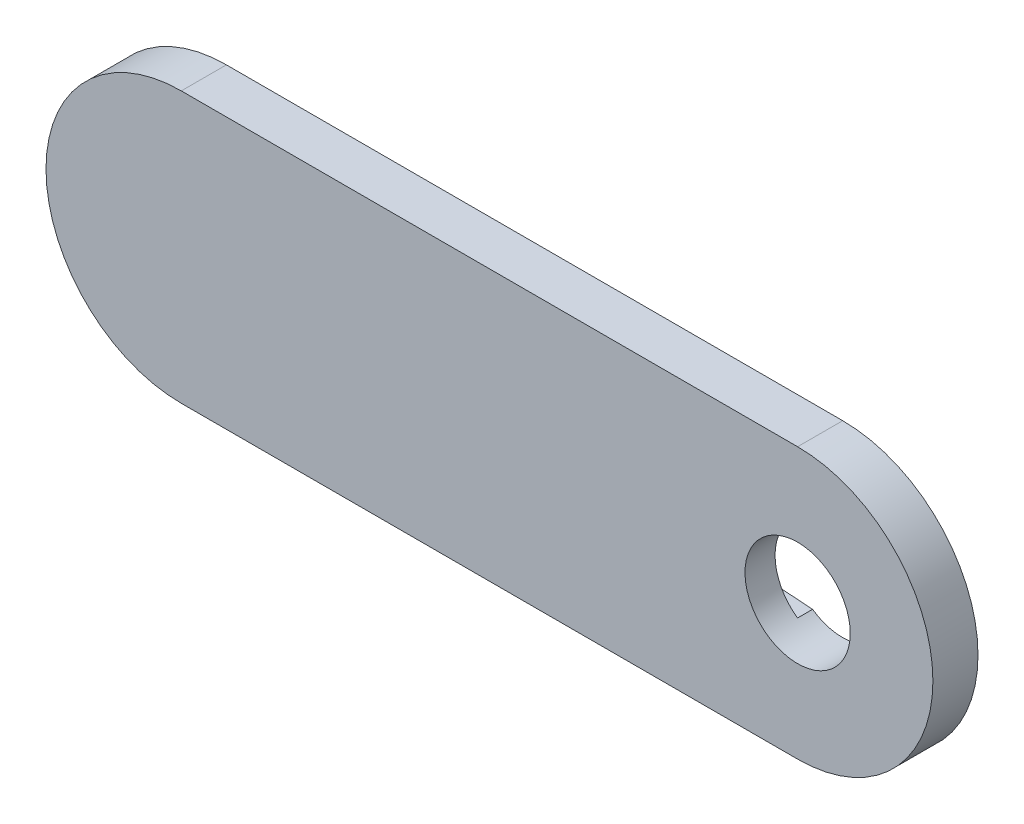
ISO-10303-21;
HEADER;
FILE_DESCRIPTION(('STEP AP214'),'2;1');
FILE_NAME('part.step','',(''),(''),'','','');
FILE_SCHEMA(('AUTOMOTIVE_DESIGN { 1 0 10303 214 1 1 1 1 }'));
ENDSEC;
DATA;
#1=APPLICATION_CONTEXT('core data for automotive mechanical design processes');
#2=APPLICATION_PROTOCOL_DEFINITION('international standard','automotive_design',2000,#1);
#3=PRODUCT_CONTEXT('',#1,'mechanical');
#4=PRODUCT('Part','Part','',(#3));
#5=PRODUCT_RELATED_PRODUCT_CATEGORY('part','',(#4));
#6=PRODUCT_DEFINITION_FORMATION('','',#4);
#7=PRODUCT_DEFINITION_CONTEXT('part definition',#1,'design');
#8=PRODUCT_DEFINITION('design','',#6,#7);
#9=PRODUCT_DEFINITION_SHAPE('','',#8);
#10=(LENGTH_UNIT() NAMED_UNIT(*) SI_UNIT(.MILLI.,.METRE.));
#11=(NAMED_UNIT(*) PLANE_ANGLE_UNIT() SI_UNIT($,.RADIAN.));
#12=(NAMED_UNIT(*) SI_UNIT($,.STERADIAN.) SOLID_ANGLE_UNIT());
#13=UNCERTAINTY_MEASURE_WITH_UNIT(LENGTH_MEASURE(1.E-05),#10,'distance_accuracy_value','');
#14=(GEOMETRIC_REPRESENTATION_CONTEXT(3) GLOBAL_UNCERTAINTY_ASSIGNED_CONTEXT((#13)) GLOBAL_UNIT_ASSIGNED_CONTEXT((#10,
#11,#12)) REPRESENTATION_CONTEXT('',''));
#15=CARTESIAN_POINT('',(0.,0.,0.));
#16=DIRECTION('',(0.,0.,1.));
#17=DIRECTION('',(1.,0.,0.));
#18=AXIS2_PLACEMENT_3D('',#15,#16,#17);
#19=CARTESIAN_POINT('',(72.389373952,13.7053718015999,0.));
#20=DIRECTION('',(0.,0.,1.));
#21=DIRECTION('',(1.,0.,0.));
#22=AXIS2_PLACEMENT_3D('',#19,#20,#21);
#23=PLANE('',#22);
#24=CARTESIAN_POINT('',(72.389373952,13.7053718015999,0.));
#25=DIRECTION('',(0.,0.,1.));
#26=DIRECTION('',(1.,0.,0.));
#27=AXIS2_PLACEMENT_3D('',#24,#25,#26);
#28=CIRCLE('',#27,9.00000000000001);
#29=CARTESIAN_POINT('',(72.389373952,4.7053718016,0.));
#30=VERTEX_POINT('',#29);
#31=CARTESIAN_POINT('',(72.389373952,22.7053718016,0.));
#32=VERTEX_POINT('',#31);
#33=EDGE_CURVE('E139',#30,#32,#28,.T.);
#34=ORIENTED_EDGE('',*,*,#33,.F.);
#35=DIRECTION('',(1.,0.,0.));
#36=VECTOR('',#35,1.);
#37=CARTESIAN_POINT('',(31.389373952,4.7053718016,0.));
#38=LINE('',#37,#36);
#39=CARTESIAN_POINT('',(31.389373952,4.7053718016,0.));
#40=VERTEX_POINT('',#39);
#41=EDGE_CURVE('E78',#40,#30,#38,.T.);
#42=ORIENTED_EDGE('',*,*,#41,.F.);
#43=CARTESIAN_POINT('',(31.389373952,13.7053718016,0.));
#44=DIRECTION('',(0.,0.,1.));
#45=DIRECTION('',(1.,0.,0.));
#46=AXIS2_PLACEMENT_3D('',#43,#44,#45);
#47=CIRCLE('',#46,9.00000000000001);
#48=CARTESIAN_POINT('',(31.389373952,22.7053718016,0.));
#49=VERTEX_POINT('',#48);
#50=EDGE_CURVE('E152',#49,#40,#47,.T.);
#51=ORIENTED_EDGE('',*,*,#50,.F.);
#52=DIRECTION('',(-1.,0.,0.));
#53=VECTOR('',#52,1.);
#54=CARTESIAN_POINT('',(72.389373952,22.7053718016,0.));
#55=LINE('',#54,#53);
#56=EDGE_CURVE('E150',#32,#49,#55,.T.);
#57=ORIENTED_EDGE('',*,*,#56,.F.);
#58=EDGE_LOOP('',(#34,#42,#51,#57));
#59=FACE_BOUND('',#58,.T.);
#60=DIRECTION('',(0.997518113068179,-0.0704103266637762,0.));
#61=VECTOR('',#60,1.);
#62=CARTESIAN_POINT('',(57.9985532986342,11.7103355754357,0.));
#63=LINE('',#62,#61);
#64=CARTESIAN_POINT('',(57.9985532986342,11.7103355754357,0.));
#65=VERTEX_POINT('',#64);
#66=CARTESIAN_POINT('',(70.3851715739607,10.8360197834721,0.));
#67=VERTEX_POINT('',#66);
#68=EDGE_CURVE('E127',#65,#67,#63,.T.);
#69=ORIENTED_EDGE('',*,*,#68,.T.);
#70=CARTESIAN_POINT('',(72.389373952,13.7053718015999,0.));
#71=DIRECTION('',(0.,0.,1.));
#72=DIRECTION('',(1.,0.,0.));
#73=AXIS2_PLACEMENT_3D('',#70,#71,#72);
#74=CIRCLE('',#73,3.50000116801028);
#75=CARTESIAN_POINT('',(70.3851715738942,16.5747238196815,0.));
#76=VERTEX_POINT('',#75);
#77=EDGE_CURVE('E128',#67,#76,#74,.T.);
#78=ORIENTED_EDGE('',*,*,#77,.T.);
#79=DIRECTION('',(-0.9975181130681,-0.070410326664897,0.));
#80=VECTOR('',#79,1.);
#81=CARTESIAN_POINT('',(70.3851715738942,16.5747238196815,0.));
#82=LINE('',#81,#80);
#83=CARTESIAN_POINT('',(57.9985532986342,15.7004080277086,0.));
#84=VERTEX_POINT('',#83);
#85=EDGE_CURVE('E123',#76,#84,#82,.T.);
#86=ORIENTED_EDGE('',*,*,#85,.T.);
#87=CARTESIAN_POINT('',(58.1393739519606,13.7053718015722,0.));
#88=DIRECTION('',(0.,0.,1.));
#89=DIRECTION('',(1.,0.,0.));
#90=AXIS2_PLACEMENT_3D('',#87,#88,#89);
#91=CIRCLE('',#90,2.00000000000001);
#92=EDGE_CURVE('E267',#84,#65,#91,.T.);
#93=ORIENTED_EDGE('',*,*,#92,.T.);
#94=EDGE_LOOP('',(#69,#78,#86,#93));
#95=FACE_BOUND('',#94,.T.);
#96=ADVANCED_FACE('F33',(#59,#95),#23,.F.);
#97=CARTESIAN_POINT('',(72.389373952,13.7053718015999,3.));
#98=DIRECTION('',(0.,0.,-1.));
#99=DIRECTION('',(-1.,0.,0.));
#100=AXIS2_PLACEMENT_3D('',#97,#98,#99);
#101=CYLINDRICAL_SURFACE('',#100,3.50000116801028);
#102=CARTESIAN_POINT('',(72.389373952,13.7053718015999,3.));
#103=DIRECTION('',(0.,0.,1.));
#104=DIRECTION('',(1.,0.,0.));
#105=AXIS2_PLACEMENT_3D('',#102,#103,#104);
#106=CIRCLE('',#105,3.50000116801028);
#107=CARTESIAN_POINT('',(75.8893751200102,13.7053718015999,3.));
#108=VERTEX_POINT('',#107);
#109=EDGE_CURVE('E132',#108,#108,#106,.T.);
#110=ORIENTED_EDGE('',*,*,#109,.T.);
#111=EDGE_LOOP('',(#110));
#112=FACE_BOUND('',#111,.T.);
#113=ORIENTED_EDGE('',*,*,#77,.F.);
#114=DIRECTION('',(0.,0.,-1.));
#115=VECTOR('',#114,1.);
#116=CARTESIAN_POINT('',(70.3851715739607,10.8360197834721,1.));
#117=LINE('',#116,#115);
#118=CARTESIAN_POINT('',(70.3851715739607,10.8360197834721,1.));
#119=VERTEX_POINT('',#118);
#120=EDGE_CURVE('E129',#119,#67,#117,.T.);
#121=ORIENTED_EDGE('',*,*,#120,.F.);
#122=CARTESIAN_POINT('',(72.389373952,13.7053718016001,1.));
#123=DIRECTION('',(0.,0.,-1.));
#124=DIRECTION('',(1.,0.,0.));
#125=AXIS2_PLACEMENT_3D('',#122,#123,#124);
#126=CIRCLE('',#125,3.50000116801025);
#127=CARTESIAN_POINT('',(70.3851715738942,16.5747238196814,1.));
#128=VERTEX_POINT('',#127);
#129=EDGE_CURVE('E110',#119,#128,#126,.T.);
#130=ORIENTED_EDGE('',*,*,#129,.T.);
#131=DIRECTION('',(0.,0.,-1.));
#132=VECTOR('',#131,1.);
#133=CARTESIAN_POINT('',(70.3851715738942,16.5747238196815,1.));
#134=LINE('',#133,#132);
#135=EDGE_CURVE('E134',#128,#76,#134,.T.);
#136=ORIENTED_EDGE('',*,*,#135,.T.);
#137=EDGE_LOOP('',(#113,#121,#130,#136));
#138=FACE_BOUND('',#137,.T.);
#139=ADVANCED_FACE('F181',(#112,#138),#101,.F.);
#140=CARTESIAN_POINT('',(72.389373952,13.7053718015999,3.));
#141=DIRECTION('',(0.,0.,1.));
#142=DIRECTION('',(1.,0.,0.));
#143=AXIS2_PLACEMENT_3D('',#140,#141,#142);
#144=PLANE('',#143);
#145=CARTESIAN_POINT('',(72.389373952,13.7053718015999,3.));
#146=DIRECTION('',(0.,0.,1.));
#147=DIRECTION('',(1.,0.,0.));
#148=AXIS2_PLACEMENT_3D('',#145,#146,#147);
#149=CIRCLE('',#148,9.00000000000001);
#150=CARTESIAN_POINT('',(72.389373952,4.7053718016,3.));
#151=VERTEX_POINT('',#150);
#152=CARTESIAN_POINT('',(72.389373952,22.7053718016,3.));
#153=VERTEX_POINT('',#152);
#154=EDGE_CURVE('E141',#151,#153,#149,.T.);
#155=ORIENTED_EDGE('',*,*,#154,.T.);
#156=DIRECTION('',(-1.,0.,0.));
#157=VECTOR('',#156,1.);
#158=CARTESIAN_POINT('',(72.389373952,22.7053718016,3.));
#159=LINE('',#158,#157);
#160=CARTESIAN_POINT('',(31.389373952,22.7053718016,3.));
#161=VERTEX_POINT('',#160);
#162=EDGE_CURVE('E85',#153,#161,#159,.T.);
#163=ORIENTED_EDGE('',*,*,#162,.T.);
#164=CARTESIAN_POINT('',(31.389373952,13.7053718016,3.));
#165=DIRECTION('',(0.,0.,1.));
#166=DIRECTION('',(1.,0.,0.));
#167=AXIS2_PLACEMENT_3D('',#164,#165,#166);
#168=CIRCLE('',#167,9.00000000000001);
#169=CARTESIAN_POINT('',(31.389373952,4.7053718016,3.));
#170=VERTEX_POINT('',#169);
#171=EDGE_CURVE('E144',#161,#170,#168,.T.);
#172=ORIENTED_EDGE('',*,*,#171,.T.);
#173=DIRECTION('',(1.,0.,0.));
#174=VECTOR('',#173,1.);
#175=CARTESIAN_POINT('',(31.389373952,4.7053718016,3.));
#176=LINE('',#175,#174);
#177=EDGE_CURVE('E57',#170,#151,#176,.T.);
#178=ORIENTED_EDGE('',*,*,#177,.T.);
#179=EDGE_LOOP('',(#155,#163,#172,#178));
#180=FACE_BOUND('',#179,.T.);
#181=ORIENTED_EDGE('',*,*,#109,.F.);
#182=EDGE_LOOP('',(#181));
#183=FACE_BOUND('',#182,.T.);
#184=ADVANCED_FACE('F185',(#180,#183),#144,.T.);
#185=CARTESIAN_POINT('',(72.389373952,13.7053718015999,3.));
#186=DIRECTION('',(0.,0.,-1.));
#187=DIRECTION('',(-1.,0.,0.));
#188=AXIS2_PLACEMENT_3D('',#185,#186,#187);
#189=CYLINDRICAL_SURFACE('',#188,9.00000000000001);
#190=ORIENTED_EDGE('',*,*,#33,.T.);
#191=DIRECTION('',(0.,0.,-1.));
#192=VECTOR('',#191,1.);
#193=CARTESIAN_POINT('',(72.389373952,22.7053718016,3.));
#194=LINE('',#193,#192);
#195=EDGE_CURVE('E11',#153,#32,#194,.T.);
#196=ORIENTED_EDGE('',*,*,#195,.F.);
#197=ORIENTED_EDGE('',*,*,#154,.F.);
#198=DIRECTION('',(0.,0.,-1.));
#199=VECTOR('',#198,1.);
#200=CARTESIAN_POINT('',(72.389373952,4.7053718016,3.));
#201=LINE('',#200,#199);
#202=EDGE_CURVE('E147',#151,#30,#201,.T.);
#203=ORIENTED_EDGE('',*,*,#202,.T.);
#204=EDGE_LOOP('',(#190,#196,#197,#203));
#205=FACE_BOUND('',#204,.T.);
#206=ADVANCED_FACE('F35',(#205),#189,.T.);
#207=CARTESIAN_POINT('',(72.389373952,22.7053718016,3.));
#208=DIRECTION('',(0.,-1.,0.));
#209=DIRECTION('',(0.,0.,-1.));
#210=AXIS2_PLACEMENT_3D('',#207,#208,#209);
#211=PLANE('',#210);
#212=ORIENTED_EDGE('',*,*,#56,.T.);
#213=DIRECTION('',(0.,0.,-1.));
#214=VECTOR('',#213,1.);
#215=CARTESIAN_POINT('',(31.389373952,22.7053718016,3.));
#216=LINE('',#215,#214);
#217=EDGE_CURVE('E41',#161,#49,#216,.T.);
#218=ORIENTED_EDGE('',*,*,#217,.F.);
#219=ORIENTED_EDGE('',*,*,#162,.F.);
#220=ORIENTED_EDGE('',*,*,#195,.T.);
#221=EDGE_LOOP('',(#212,#218,#219,#220));
#222=FACE_BOUND('',#221,.T.);
#223=ADVANCED_FACE('F177',(#222),#211,.F.);
#224=CARTESIAN_POINT('',(31.389373952,13.7053718016,3.));
#225=DIRECTION('',(0.,0.,-1.));
#226=DIRECTION('',(-1.,0.,0.));
#227=AXIS2_PLACEMENT_3D('',#224,#225,#226);
#228=CYLINDRICAL_SURFACE('',#227,9.00000000000001);
#229=ORIENTED_EDGE('',*,*,#50,.T.);
#230=DIRECTION('',(0.,0.,-1.));
#231=VECTOR('',#230,1.);
#232=CARTESIAN_POINT('',(31.389373952,4.7053718016,3.));
#233=LINE('',#232,#231);
#234=EDGE_CURVE('E156',#170,#40,#233,.T.);
#235=ORIENTED_EDGE('',*,*,#234,.F.);
#236=ORIENTED_EDGE('',*,*,#171,.F.);
#237=ORIENTED_EDGE('',*,*,#217,.T.);
#238=EDGE_LOOP('',(#229,#235,#236,#237));
#239=FACE_BOUND('',#238,.T.);
#240=ADVANCED_FACE('F161',(#239),#228,.T.);
#241=CARTESIAN_POINT('',(31.389373952,4.7053718016,3.));
#242=DIRECTION('',(0.,1.,0.));
#243=DIRECTION('',(0.,0.,1.));
#244=AXIS2_PLACEMENT_3D('',#241,#242,#243);
#245=PLANE('',#244);
#246=ORIENTED_EDGE('',*,*,#41,.T.);
#247=ORIENTED_EDGE('',*,*,#202,.F.);
#248=ORIENTED_EDGE('',*,*,#177,.F.);
#249=ORIENTED_EDGE('',*,*,#234,.T.);
#250=EDGE_LOOP('',(#246,#247,#248,#249));
#251=FACE_BOUND('',#250,.T.);
#252=ADVANCED_FACE('F169',(#251),#245,.F.);
#253=CARTESIAN_POINT('',(58.1393739519606,13.7053718015722,1.));
#254=DIRECTION('',(0.,0.,-1.));
#255=DIRECTION('',(-1.,0.,0.));
#256=AXIS2_PLACEMENT_3D('',#253,#254,#255);
#257=CYLINDRICAL_SURFACE('',#256,2.00000000000001);
#258=ORIENTED_EDGE('',*,*,#92,.F.);
#259=DIRECTION('',(0.,0.,-1.));
#260=VECTOR('',#259,1.);
#261=CARTESIAN_POINT('',(57.9985532986342,15.7004080277086,1.));
#262=LINE('',#261,#260);
#263=CARTESIAN_POINT('',(57.9985532986342,15.7004080277086,1.));
#264=VERTEX_POINT('',#263);
#265=EDGE_CURVE('E122',#264,#84,#262,.T.);
#266=ORIENTED_EDGE('',*,*,#265,.F.);
#267=CARTESIAN_POINT('',(58.1393739519606,13.7053718015722,1.));
#268=DIRECTION('',(0.,0.,1.));
#269=DIRECTION('',(1.,0.,0.));
#270=AXIS2_PLACEMENT_3D('',#267,#268,#269);
#271=CIRCLE('',#270,2.00000000000001);
#272=CARTESIAN_POINT('',(57.9985532986342,11.7103355754357,1.));
#273=VERTEX_POINT('',#272);
#274=EDGE_CURVE('E108',#264,#273,#271,.T.);
#275=ORIENTED_EDGE('',*,*,#274,.T.);
#276=DIRECTION('',(0.,0.,-1.));
#277=VECTOR('',#276,1.);
#278=CARTESIAN_POINT('',(57.9985532986342,11.7103355754357,1.));
#279=LINE('',#278,#277);
#280=EDGE_CURVE('E120',#273,#65,#279,.T.);
#281=ORIENTED_EDGE('',*,*,#280,.T.);
#282=EDGE_LOOP('',(#258,#266,#275,#281));
#283=FACE_BOUND('',#282,.T.);
#284=ADVANCED_FACE('F119',(#283),#257,.F.);
#285=CARTESIAN_POINT('',(57.9985532986342,11.7103355754357,1.));
#286=DIRECTION('',(0.0704103266637761,0.997518113068179,0.));
#287=DIRECTION('',(-0.997518113068179,0.0704103266637762,0.));
#288=AXIS2_PLACEMENT_3D('',#285,#286,#287);
#289=PLANE('',#288);
#290=ORIENTED_EDGE('',*,*,#68,.F.);
#291=ORIENTED_EDGE('',*,*,#280,.F.);
#292=DIRECTION('',(0.997518113068179,-0.0704103266637762,0.));
#293=VECTOR('',#292,1.);
#294=CARTESIAN_POINT('',(57.9985532986342,11.7103355754357,1.));
#295=LINE('',#294,#293);
#296=EDGE_CURVE('E105',#273,#119,#295,.T.);
#297=ORIENTED_EDGE('',*,*,#296,.T.);
#298=ORIENTED_EDGE('',*,*,#120,.T.);
#299=EDGE_LOOP('',(#290,#291,#297,#298));
#300=FACE_BOUND('',#299,.T.);
#301=ADVANCED_FACE('F125',(#300),#289,.T.);
#302=CARTESIAN_POINT('',(70.3851715738942,16.5747238196815,1.));
#303=DIRECTION('',(0.070410326664897,-0.9975181130681,0.));
#304=DIRECTION('',(0.9975181130681,0.070410326664897,0.));
#305=AXIS2_PLACEMENT_3D('',#302,#303,#304);
#306=PLANE('',#305);
#307=ORIENTED_EDGE('',*,*,#85,.F.);
#308=ORIENTED_EDGE('',*,*,#135,.F.);
#309=DIRECTION('',(-0.9975181130681,-0.070410326664897,0.));
#310=VECTOR('',#309,1.);
#311=CARTESIAN_POINT('',(70.3851715738942,16.5747238196815,1.));
#312=LINE('',#311,#310);
#313=EDGE_CURVE('E48',#128,#264,#312,.T.);
#314=ORIENTED_EDGE('',*,*,#313,.T.);
#315=ORIENTED_EDGE('',*,*,#265,.T.);
#316=EDGE_LOOP('',(#307,#308,#314,#315));
#317=FACE_BOUND('',#316,.T.);
#318=ADVANCED_FACE('F193',(#317),#306,.T.);
#319=CARTESIAN_POINT('',(58.1393739519606,13.7053718015722,1.));
#320=DIRECTION('',(0.,0.,1.));
#321=DIRECTION('',(1.,0.,0.));
#322=AXIS2_PLACEMENT_3D('',#319,#320,#321);
#323=PLANE('',#322);
#324=ORIENTED_EDGE('',*,*,#274,.F.);
#325=ORIENTED_EDGE('',*,*,#313,.F.);
#326=ORIENTED_EDGE('',*,*,#129,.F.);
#327=ORIENTED_EDGE('',*,*,#296,.F.);
#328=EDGE_LOOP('',(#324,#325,#326,#327));
#329=FACE_BOUND('',#328,.T.);
#330=ADVANCED_FACE('F107',(#329),#323,.F.);
#331=CLOSED_SHELL('',(#96,#139,#184,#206,#223,#240,#252,#284,#301,#318,#330));
#332=MANIFOLD_SOLID_BREP('B2',#331);
#333=ADVANCED_BREP_SHAPE_REPRESENTATION('',(#18,#332),#14);
#334=SHAPE_DEFINITION_REPRESENTATION(#9,#333);
ENDSEC;
END-ISO-10303-21;
